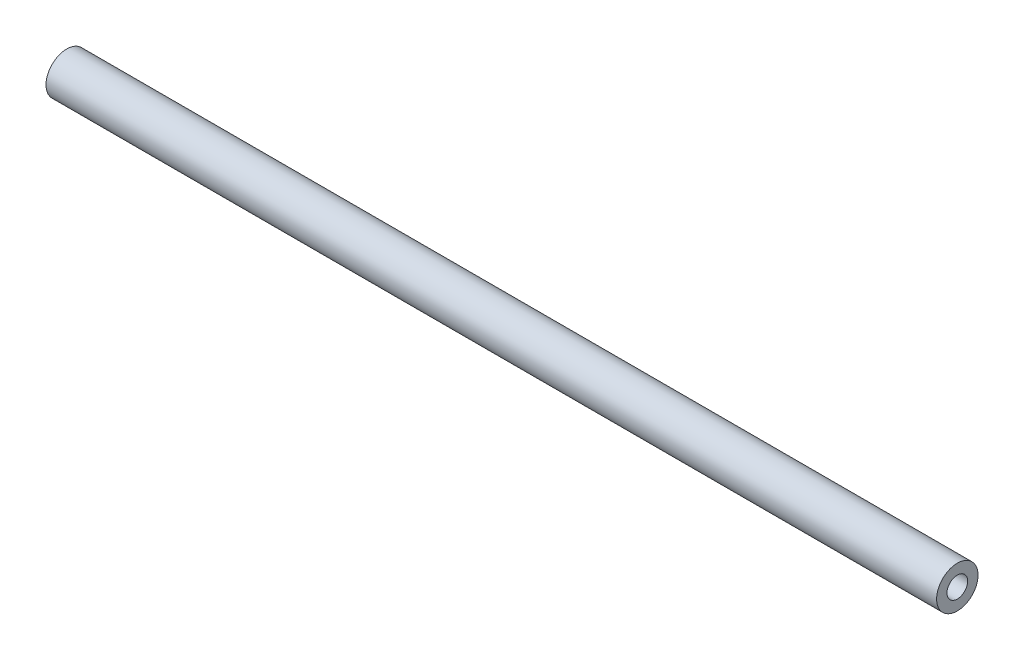
ISO-10303-21;
HEADER;
FILE_DESCRIPTION(('STEP AP214'),'2;1');
FILE_NAME('part.step','',(''),(''),'','','');
FILE_SCHEMA(('AUTOMOTIVE_DESIGN { 1 0 10303 214 1 1 1 1 }'));
ENDSEC;
DATA;
#1=APPLICATION_CONTEXT('core data for automotive mechanical design processes');
#2=APPLICATION_PROTOCOL_DEFINITION('international standard','automotive_design',2000,#1);
#3=PRODUCT_CONTEXT('',#1,'mechanical');
#4=PRODUCT('Part','Part','',(#3));
#5=PRODUCT_RELATED_PRODUCT_CATEGORY('part','',(#4));
#6=PRODUCT_DEFINITION_FORMATION('','',#4);
#7=PRODUCT_DEFINITION_CONTEXT('part definition',#1,'design');
#8=PRODUCT_DEFINITION('design','',#6,#7);
#9=PRODUCT_DEFINITION_SHAPE('','',#8);
#10=(LENGTH_UNIT() NAMED_UNIT(*) SI_UNIT(.MILLI.,.METRE.));
#11=(NAMED_UNIT(*) PLANE_ANGLE_UNIT() SI_UNIT($,.RADIAN.));
#12=(NAMED_UNIT(*) SI_UNIT($,.STERADIAN.) SOLID_ANGLE_UNIT());
#13=UNCERTAINTY_MEASURE_WITH_UNIT(LENGTH_MEASURE(1.E-05),#10,'distance_accuracy_value','');
#14=(GEOMETRIC_REPRESENTATION_CONTEXT(3) GLOBAL_UNCERTAINTY_ASSIGNED_CONTEXT((#13)) GLOBAL_UNIT_ASSIGNED_CONTEXT((#10,
#11,#12)) REPRESENTATION_CONTEXT('',''));
#15=CARTESIAN_POINT('',(0.,0.,0.));
#16=DIRECTION('',(0.,0.,1.));
#17=DIRECTION('',(1.,0.,0.));
#18=AXIS2_PLACEMENT_3D('',#15,#16,#17);
#19=CARTESIAN_POINT('',(95.0000001490116,21.,20.7000001117587));
#20=DIRECTION('',(-1.,0.,0.));
#21=DIRECTION('',(0.,0.,1.));
#22=AXIS2_PLACEMENT_3D('',#19,#20,#21);
#23=CYLINDRICAL_SURFACE('',#22,1.);
#24=CARTESIAN_POINT('',(95.0000001490116,21.,20.7000001117587));
#25=DIRECTION('',(-1.,0.,0.));
#26=DIRECTION('',(0.,0.,1.));
#27=AXIS2_PLACEMENT_3D('',#24,#25,#26);
#28=CIRCLE('',#27,1.);
#29=CARTESIAN_POINT('',(95.0000001490116,21.,21.7000001117587));
#30=VERTEX_POINT('',#29);
#31=EDGE_CURVE('E27',#30,#30,#28,.F.);
#32=ORIENTED_EDGE('',*,*,#31,.T.);
#33=EDGE_LOOP('',(#32));
#34=FACE_BOUND('',#33,.T.);
#35=CARTESIAN_POINT('',(9.00000014901162,21.,20.7000001117587));
#36=DIRECTION('',(-1.,0.,0.));
#37=DIRECTION('',(0.,0.,1.));
#38=AXIS2_PLACEMENT_3D('',#35,#36,#37);
#39=CIRCLE('',#38,1.);
#40=CARTESIAN_POINT('',(9.00000014901162,21.,21.7000001117587));
#41=VERTEX_POINT('',#40);
#42=EDGE_CURVE('E18',#41,#41,#39,.F.);
#43=ORIENTED_EDGE('',*,*,#42,.F.);
#44=EDGE_LOOP('',(#43));
#45=FACE_BOUND('',#44,.T.);
#46=ADVANCED_FACE('F15',(#34,#45),#23,.F.);
#47=CARTESIAN_POINT('',(9.00000014901162,21.,20.7000001117587));
#48=DIRECTION('',(-1.,0.,0.));
#49=DIRECTION('',(0.,0.,1.));
#50=AXIS2_PLACEMENT_3D('',#47,#48,#49);
#51=PLANE('',#50);
#52=ORIENTED_EDGE('',*,*,#42,.T.);
#53=EDGE_LOOP('',(#52));
#54=FACE_BOUND('',#53,.T.);
#55=CARTESIAN_POINT('',(9.00000014901162,21.,20.7000001117587));
#56=DIRECTION('',(-1.,0.,0.));
#57=DIRECTION('',(0.,0.,1.));
#58=AXIS2_PLACEMENT_3D('',#55,#56,#57);
#59=CIRCLE('',#58,2.);
#60=CARTESIAN_POINT('',(9.00000014901162,21.,22.7000001117587));
#61=VERTEX_POINT('',#60);
#62=EDGE_CURVE('E22',#61,#61,#59,.F.);
#63=ORIENTED_EDGE('',*,*,#62,.F.);
#64=EDGE_LOOP('',(#63));
#65=FACE_BOUND('',#64,.T.);
#66=ADVANCED_FACE('F35',(#54,#65),#51,.T.);
#67=CARTESIAN_POINT('',(95.0000001490116,21.,20.7000001117587));
#68=DIRECTION('',(-1.,0.,0.));
#69=DIRECTION('',(0.,0.,1.));
#70=AXIS2_PLACEMENT_3D('',#67,#68,#69);
#71=PLANE('',#70);
#72=ORIENTED_EDGE('',*,*,#31,.F.);
#73=EDGE_LOOP('',(#72));
#74=FACE_BOUND('',#73,.T.);
#75=CARTESIAN_POINT('',(95.0000001490116,21.,20.7000001117587));
#76=DIRECTION('',(-1.,0.,0.));
#77=DIRECTION('',(0.,0.,1.));
#78=AXIS2_PLACEMENT_3D('',#75,#76,#77);
#79=CIRCLE('',#78,2.);
#80=CARTESIAN_POINT('',(95.0000001490116,21.,22.7000001117587));
#81=VERTEX_POINT('',#80);
#82=EDGE_CURVE('E10',#81,#81,#79,.T.);
#83=ORIENTED_EDGE('',*,*,#82,.F.);
#84=EDGE_LOOP('',(#83));
#85=FACE_BOUND('',#84,.T.);
#86=ADVANCED_FACE('F43',(#74,#85),#71,.F.);
#87=CARTESIAN_POINT('',(95.0000001490116,21.,20.7000001117587));
#88=DIRECTION('',(-1.,0.,0.));
#89=DIRECTION('',(0.,0.,1.));
#90=AXIS2_PLACEMENT_3D('',#87,#88,#89);
#91=CYLINDRICAL_SURFACE('',#90,2.);
#92=ORIENTED_EDGE('',*,*,#82,.T.);
#93=EDGE_LOOP('',(#92));
#94=FACE_BOUND('',#93,.T.);
#95=ORIENTED_EDGE('',*,*,#62,.T.);
#96=EDGE_LOOP('',(#95));
#97=FACE_BOUND('',#96,.T.);
#98=ADVANCED_FACE('F44',(#94,#97),#91,.T.);
#99=CLOSED_SHELL('',(#46,#66,#86,#98));
#100=MANIFOLD_SOLID_BREP('B1',#99);
#101=ADVANCED_BREP_SHAPE_REPRESENTATION('',(#18,#100),#14);
#102=SHAPE_DEFINITION_REPRESENTATION(#9,#101);
ENDSEC;
END-ISO-10303-21;
